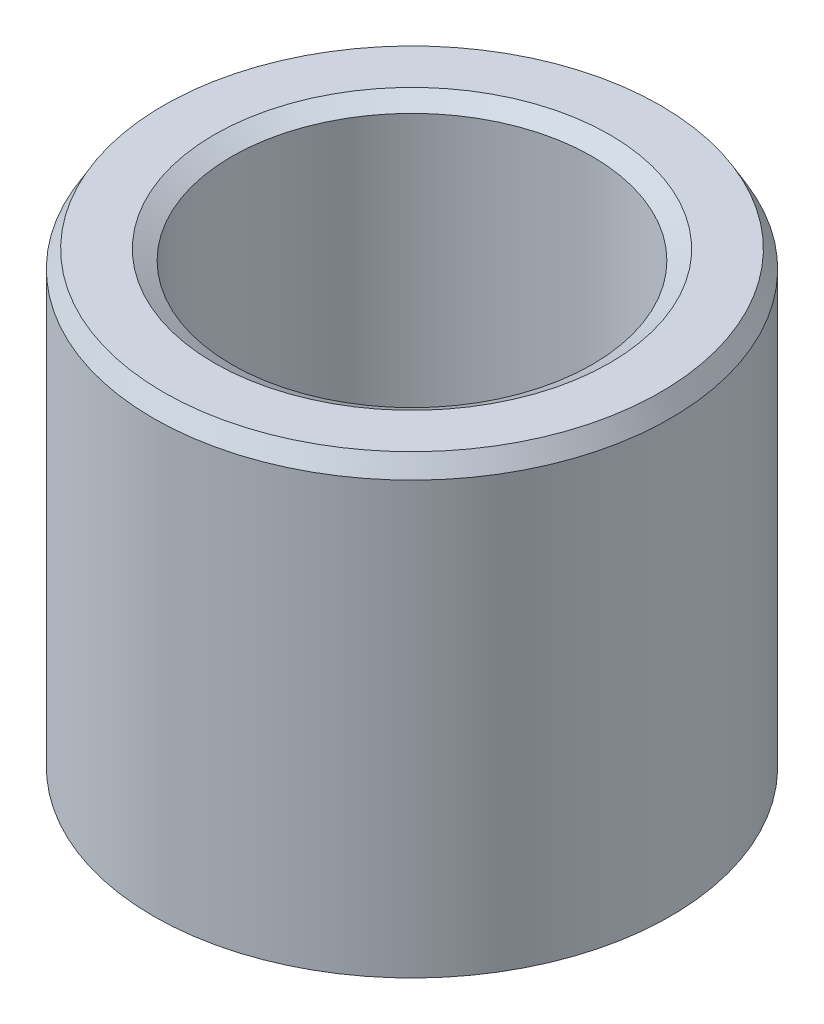
ISO-10303-21;
HEADER;
FILE_DESCRIPTION(('STEP AP214'),'2;1');
FILE_NAME('part.step','',(''),(''),'','','');
FILE_SCHEMA(('AUTOMOTIVE_DESIGN { 1 0 10303 214 1 1 1 1 }'));
ENDSEC;
DATA;
#1=APPLICATION_CONTEXT('core data for automotive mechanical design processes');
#2=APPLICATION_PROTOCOL_DEFINITION('international standard','automotive_design',2000,#1);
#3=PRODUCT_CONTEXT('',#1,'mechanical');
#4=PRODUCT('Part','Part','',(#3));
#5=PRODUCT_RELATED_PRODUCT_CATEGORY('part','',(#4));
#6=PRODUCT_DEFINITION_FORMATION('','',#4);
#7=PRODUCT_DEFINITION_CONTEXT('part definition',#1,'design');
#8=PRODUCT_DEFINITION('design','',#6,#7);
#9=PRODUCT_DEFINITION_SHAPE('','',#8);
#10=(LENGTH_UNIT() NAMED_UNIT(*) SI_UNIT(.MILLI.,.METRE.));
#11=(NAMED_UNIT(*) PLANE_ANGLE_UNIT() SI_UNIT($,.RADIAN.));
#12=(NAMED_UNIT(*) SI_UNIT($,.STERADIAN.) SOLID_ANGLE_UNIT());
#13=UNCERTAINTY_MEASURE_WITH_UNIT(LENGTH_MEASURE(1.E-05),#10,'distance_accuracy_value','');
#14=(GEOMETRIC_REPRESENTATION_CONTEXT(3) GLOBAL_UNCERTAINTY_ASSIGNED_CONTEXT((#13)) GLOBAL_UNIT_ASSIGNED_CONTEXT((#10,
#11,#12)) REPRESENTATION_CONTEXT('',''));
#15=CARTESIAN_POINT('',(0.,0.,0.));
#16=DIRECTION('',(0.,0.,1.));
#17=DIRECTION('',(1.,0.,0.));
#18=AXIS2_PLACEMENT_3D('',#15,#16,#17);
#19=CARTESIAN_POINT('',(0.,75.4030984293834,0.));
#20=DIRECTION('',(0.,-1.,0.));
#21=DIRECTION('',(0.,0.,-1.));
#22=AXIS2_PLACEMENT_3D('',#19,#20,#21);
#23=CYLINDRICAL_SURFACE('',#22,42.5);
#24=CARTESIAN_POINT('',(0.,1.66126296134479,0.));
#25=DIRECTION('',(0.,1.,0.));
#26=DIRECTION('',(0.,0.,1.));
#27=AXIS2_PLACEMENT_3D('',#24,#25,#26);
#28=CIRCLE('',#27,42.5);
#29=CARTESIAN_POINT('',(0.,1.66126296134478,-42.5));
#30=VERTEX_POINT('',#29);
#31=EDGE_CURVE('E10',#30,#30,#28,.T.);
#32=CARTESIAN_POINT('',(0.,72.5257065756022,0.));
#33=DIRECTION('',(0.,1.,0.));
#34=DIRECTION('',(0.,0.,1.));
#35=AXIS2_PLACEMENT_3D('',#32,#33,#34);
#36=CIRCLE('',#35,42.5);
#37=CARTESIAN_POINT('',(0.,72.5257065756022,-42.5));
#38=VERTEX_POINT('',#37);
#39=EDGE_CURVE('E50',#38,#38,#36,.F.);
#40=CARTESIAN_POINT('',(0.,1.66126296134478,-42.5));
#41=CARTESIAN_POINT('',(0.,2.3994342489933,-42.5));
#42=CARTESIAN_POINT('',(0.,3.13760553664181,-42.5));
#43=CARTESIAN_POINT('',(0.,4.61394811193884,-42.5));
#44=CARTESIAN_POINT('',(0.,5.35211939958735,-42.5));
#45=CARTESIAN_POINT('',(0.,6.82846197488438,-42.5));
#46=CARTESIAN_POINT('',(0.,7.5666332625329,-42.5));
#47=CARTESIAN_POINT('',(0.,9.04297583782992,-42.5));
#48=CARTESIAN_POINT('',(0.,9.78114712547844,-42.5));
#49=CARTESIAN_POINT('',(0.,11.2574897007755,-42.5));
#50=CARTESIAN_POINT('',(0.,11.995660988424,-42.5));
#51=CARTESIAN_POINT('',(0.,13.472003563721,-42.5));
#52=CARTESIAN_POINT('',(0.,14.2101748513695,-42.5));
#53=CARTESIAN_POINT('',(0.,15.6865174266666,-42.5));
#54=CARTESIAN_POINT('',(0.,16.4246887143151,-42.5));
#55=CARTESIAN_POINT('',(0.,17.9010312896121,-42.5));
#56=CARTESIAN_POINT('',(0.,18.6392025772606,-42.5));
#57=CARTESIAN_POINT('',(0.,20.1155451525576,-42.5));
#58=CARTESIAN_POINT('',(0.,20.8537164402062,-42.5));
#59=CARTESIAN_POINT('',(0.,22.3300590155032,-42.5));
#60=CARTESIAN_POINT('',(0.,23.0682303031517,-42.5));
#61=CARTESIAN_POINT('',(0.,24.5445728784487,-42.5));
#62=CARTESIAN_POINT('',(0.,25.2827441660972,-42.5));
#63=CARTESIAN_POINT('',(0.,26.7590867413943,-42.5));
#64=CARTESIAN_POINT('',(0.,27.4972580290428,-42.5));
#65=CARTESIAN_POINT('',(0.,28.9736006043398,-42.5));
#66=CARTESIAN_POINT('',(0.,29.7117718919883,-42.5));
#67=CARTESIAN_POINT('',(0.,31.1881144672854,-42.5));
#68=CARTESIAN_POINT('',(0.,31.9262857549339,-42.5));
#69=CARTESIAN_POINT('',(0.,33.4026283302309,-42.5));
#70=CARTESIAN_POINT('',(0.,34.1407996178794,-42.5));
#71=CARTESIAN_POINT('',(0.,35.6171421931764,-42.5));
#72=CARTESIAN_POINT('',(0.,36.355313480825,-42.5));
#73=CARTESIAN_POINT('',(0.,37.831656056122,-42.5));
#74=CARTESIAN_POINT('',(0.,38.5698273437705,-42.5));
#75=CARTESIAN_POINT('',(0.,40.0461699190675,-42.5));
#76=CARTESIAN_POINT('',(0.,40.7843412067161,-42.5));
#77=CARTESIAN_POINT('',(0.,42.2606837820131,-42.5));
#78=CARTESIAN_POINT('',(0.,42.9988550696616,-42.5));
#79=CARTESIAN_POINT('',(0.,44.4751976449586,-42.5));
#80=CARTESIAN_POINT('',(0.,45.2133689326071,-42.5));
#81=CARTESIAN_POINT('',(0.,46.6897115079042,-42.5));
#82=CARTESIAN_POINT('',(0.,47.4278827955527,-42.5));
#83=CARTESIAN_POINT('',(0.,48.9042253708497,-42.5));
#84=CARTESIAN_POINT('',(0.,49.6423966584982,-42.5));
#85=CARTESIAN_POINT('',(0.,51.1187392337953,-42.5));
#86=CARTESIAN_POINT('',(0.,51.8569105214438,-42.5));
#87=CARTESIAN_POINT('',(0.,53.3332530967408,-42.5));
#88=CARTESIAN_POINT('',(0.,54.0714243843893,-42.5));
#89=CARTESIAN_POINT('',(0.,55.5477669596863,-42.5));
#90=CARTESIAN_POINT('',(0.,56.2859382473349,-42.5));
#91=CARTESIAN_POINT('',(0.,57.7622808226319,-42.5));
#92=CARTESIAN_POINT('',(0.,58.5004521102804,-42.5));
#93=CARTESIAN_POINT('',(0.,59.9767946855774,-42.5));
#94=CARTESIAN_POINT('',(0.,60.7149659732259,-42.5));
#95=CARTESIAN_POINT('',(0.,62.191308548523,-42.5));
#96=CARTESIAN_POINT('',(0.,62.9294798361715,-42.5));
#97=CARTESIAN_POINT('',(0.,64.4058224114685,-42.5));
#98=CARTESIAN_POINT('',(0.,65.143993699117,-42.5));
#99=CARTESIAN_POINT('',(0.,66.6203362744141,-42.5));
#100=CARTESIAN_POINT('',(0.,67.3585075620626,-42.5));
#101=CARTESIAN_POINT('',(0.,68.8348501373596,-42.5));
#102=CARTESIAN_POINT('',(0.,69.5730214250081,-42.5));
#103=CARTESIAN_POINT('',(0.,71.0493640003051,-42.5));
#104=CARTESIAN_POINT('',(0.,71.7875352879537,-42.5));
#105=CARTESIAN_POINT('',(0.,72.5257065756022,-42.5));
#106=B_SPLINE_CURVE_WITH_KNOTS('',3,(#40,#41,#42,#43,#44,#45,#46,#47,#48,#49,#50,#51,#52,#53,
#54,#55,#56,#57,#58,#59,#60,#61,#62,#63,#64,#65,#66,#67,#68,#69,#70,#71,#72,#73,#74,#75,#76,#77,
#78,#79,#80,#81,#82,#83,#84,#85,#86,#87,#88,#89,#90,#91,#92,#93,#94,#95,#96,#97,#98,#99,#100,
#101,#102,#103,#104,#105),.UNSPECIFIED.,.F.,.F.,(4,2,2,2,2,2,2,2,2,2,2,2,2,2,2,2,2,2,2,2,2,2,2,
2,2,2,2,2,2,2,2,2,4),(0.,2.21451386294555,4.42902772589109,6.64354158883664,8.85805545178217,
11.0725693147277,13.2870831776733,15.5015970406188,17.7161109035643,19.9306247665099,
22.1451386294554,24.359652492401,26.5741663553465,28.7886802182921,31.0031940812376,
33.2177079441832,35.4322218071287,37.6467356700742,39.8612495330198,42.0757633959653,
44.2902772589109,46.5047911218564,48.719304984802,50.9338188477475,53.1483327106931,
55.3628465736386,57.5773604365841,59.7918742995297,62.0063881624752,64.2209020254208,
66.4354158883663,68.6499297513119,70.8644436142574),.UNSPECIFIED.);
#107=EDGE_CURVE('BSEAM39',#30,#38,#106,.T.);
#108=ORIENTED_EDGE('',*,*,#31,.T.);
#109=ORIENTED_EDGE('',*,*,#39,.T.);
#110=ORIENTED_EDGE('',*,*,#107,.T.);
#111=ORIENTED_EDGE('',*,*,#107,.F.);
#112=EDGE_LOOP('',(#108,#110,#109,#111));
#113=FACE_BOUND('',#112,.T.);
#114=ADVANCED_FACE('F39',(#113),#23,.T.);
#115=CARTESIAN_POINT('',(0.,75.4030984293834,0.));
#116=DIRECTION('',(0.,1.,0.));
#117=DIRECTION('',(0.,0.,1.));
#118=AXIS2_PLACEMENT_3D('',#115,#116,#117);
#119=PLANE('',#118);
#120=CARTESIAN_POINT('',(0.,75.4030984293834,0.));
#121=DIRECTION('',(0.,1.,0.));
#122=DIRECTION('',(0.,0.,1.));
#123=AXIS2_PLACEMENT_3D('',#120,#121,#122);
#124=CIRCLE('',#123,32.5040358014817);
#125=CARTESIAN_POINT('',(0.,75.4030984293834,32.5040358014817));
#126=VERTEX_POINT('',#125);
#127=EDGE_CURVE('E58',#126,#126,#124,.F.);
#128=ORIENTED_EDGE('',*,*,#127,.T.);
#129=EDGE_LOOP('',(#128));
#130=FACE_BOUND('',#129,.T.);
#131=CARTESIAN_POINT('',(0.,75.4030984293834,0.));
#132=DIRECTION('',(0.,1.,0.));
#133=DIRECTION('',(0.,0.,1.));
#134=AXIS2_PLACEMENT_3D('',#131,#132,#133);
#135=CIRCLE('',#134,40.8387370386554);
#136=CARTESIAN_POINT('',(0.,75.4030984293834,40.8387370386554));
#137=VERTEX_POINT('',#136);
#138=EDGE_CURVE('E61',#137,#137,#135,.T.);
#139=ORIENTED_EDGE('',*,*,#138,.T.);
#140=EDGE_LOOP('',(#139));
#141=FACE_BOUND('',#140,.T.);
#142=ADVANCED_FACE('F88',(#130,#141),#119,.T.);
#143=CARTESIAN_POINT('',(0.,0.,0.));
#144=DIRECTION('',(0.,1.,0.));
#145=DIRECTION('',(0.,0.,1.));
#146=AXIS2_PLACEMENT_3D('',#143,#144,#145);
#147=PLANE('',#146);
#148=CARTESIAN_POINT('',(0.,0.,0.));
#149=DIRECTION('',(0.,1.,0.));
#150=DIRECTION('',(0.,0.,1.));
#151=AXIS2_PLACEMENT_3D('',#148,#149,#150);
#152=CIRCLE('',#151,31.287906909045);
#153=CARTESIAN_POINT('',(0.,0.,-31.287906909045));
#154=VERTEX_POINT('',#153);
#155=EDGE_CURVE('E51',#154,#154,#152,.T.);
#156=ORIENTED_EDGE('',*,*,#155,.T.);
#157=EDGE_LOOP('',(#156));
#158=FACE_BOUND('',#157,.T.);
#159=CARTESIAN_POINT('',(0.,0.,0.));
#160=DIRECTION('',(0.,1.,0.));
#161=DIRECTION('',(0.,0.,1.));
#162=AXIS2_PLACEMENT_3D('',#159,#160,#161);
#163=CIRCLE('',#162,39.6226081462185);
#164=CARTESIAN_POINT('',(0.,0.,39.6226081462185));
#165=VERTEX_POINT('',#164);
#166=EDGE_CURVE('E54',#165,#165,#163,.F.);
#167=ORIENTED_EDGE('',*,*,#166,.T.);
#168=EDGE_LOOP('',(#167));
#169=FACE_BOUND('',#168,.T.);
#170=ADVANCED_FACE('F83',(#158,#169),#147,.F.);
#171=CARTESIAN_POINT('',(0.,75.4030984293834,0.));
#172=DIRECTION('',(0.,-1.,0.));
#173=DIRECTION('',(0.,0.,-1.));
#174=AXIS2_PLACEMENT_3D('',#171,#172,#173);
#175=CYLINDRICAL_SURFACE('',#174,29.6266439477002);
#176=CARTESIAN_POINT('',(0.,73.7418354680387,0.));
#177=DIRECTION('',(0.,1.,0.));
#178=DIRECTION('',(0.,0.,1.));
#179=AXIS2_PLACEMENT_3D('',#176,#177,#178);
#180=CIRCLE('',#179,29.6266439477002);
#181=CARTESIAN_POINT('',(0.,73.7418354680387,-29.6266439477002));
#182=VERTEX_POINT('',#181);
#183=EDGE_CURVE('E67',#182,#182,#180,.T.);
#184=CARTESIAN_POINT('',(0.,2.87739185378143,0.));
#185=DIRECTION('',(0.,1.,0.));
#186=DIRECTION('',(0.,0.,1.));
#187=AXIS2_PLACEMENT_3D('',#184,#185,#186);
#188=CIRCLE('',#187,29.6266439477002);
#189=CARTESIAN_POINT('',(0.,2.87739185378141,-29.6266439477002));
#190=VERTEX_POINT('',#189);
#191=EDGE_CURVE('E69',#190,#190,#188,.F.);
#192=CARTESIAN_POINT('',(0.,73.7418354680387,-29.6266439477002));
#193=CARTESIAN_POINT('',(0.,73.0036641803902,-29.6266439477002));
#194=CARTESIAN_POINT('',(0.,72.2654928927416,-29.6266439477002));
#195=CARTESIAN_POINT('',(0.,70.7891503174446,-29.6266439477002));
#196=CARTESIAN_POINT('',(0.,70.0509790297961,-29.6266439477002));
#197=CARTESIAN_POINT('',(0.,68.5746364544991,-29.6266439477002));
#198=CARTESIAN_POINT('',(0.,67.8364651668506,-29.6266439477002));
#199=CARTESIAN_POINT('',(0.,66.3601225915535,-29.6266439477002));
#200=CARTESIAN_POINT('',(0.,65.621951303905,-29.6266439477002));
#201=CARTESIAN_POINT('',(0.,64.145608728608,-29.6266439477002));
#202=CARTESIAN_POINT('',(0.,63.4074374409595,-29.6266439477002));
#203=CARTESIAN_POINT('',(0.,61.9310948656625,-29.6266439477002));
#204=CARTESIAN_POINT('',(0.,61.192923578014,-29.6266439477002));
#205=CARTESIAN_POINT('',(0.,59.7165810027169,-29.6266439477002));
#206=CARTESIAN_POINT('',(0.,58.9784097150684,-29.6266439477002));
#207=CARTESIAN_POINT('',(0.,57.5020671397714,-29.6266439477002));
#208=CARTESIAN_POINT('',(0.,56.7638958521229,-29.6266439477002));
#209=CARTESIAN_POINT('',(0.,55.2875532768258,-29.6266439477002));
#210=CARTESIAN_POINT('',(0.,54.5493819891773,-29.6266439477002));
#211=CARTESIAN_POINT('',(0.,53.0730394138803,-29.6266439477002));
#212=CARTESIAN_POINT('',(0.,52.3348681262318,-29.6266439477002));
#213=CARTESIAN_POINT('',(0.,50.8585255509348,-29.6266439477002));
#214=CARTESIAN_POINT('',(0.,50.1203542632863,-29.6266439477002));
#215=CARTESIAN_POINT('',(0.,48.6440116879892,-29.6266439477002));
#216=CARTESIAN_POINT('',(0.,47.9058404003407,-29.6266439477002));
#217=CARTESIAN_POINT('',(0.,46.4294978250437,-29.6266439477002));
#218=CARTESIAN_POINT('',(0.,45.6913265373952,-29.6266439477002));
#219=CARTESIAN_POINT('',(0.,44.2149839620982,-29.6266439477002));
#220=CARTESIAN_POINT('',(0.,43.4768126744496,-29.6266439477002));
#221=CARTESIAN_POINT('',(0.,42.0004700991526,-29.6266439477002));
#222=CARTESIAN_POINT('',(0.,41.2622988115041,-29.6266439477002));
#223=CARTESIAN_POINT('',(0.,39.7859562362071,-29.6266439477002));
#224=CARTESIAN_POINT('',(0.,39.0477849485586,-29.6266439477002));
#225=CARTESIAN_POINT('',(0.,37.5714423732615,-29.6266439477002));
#226=CARTESIAN_POINT('',(0.,36.833271085613,-29.6266439477002));
#227=CARTESIAN_POINT('',(0.,35.356928510316,-29.6266439477002));
#228=CARTESIAN_POINT('',(0.,34.6187572226675,-29.6266439477002));
#229=CARTESIAN_POINT('',(0.,33.1424146473705,-29.6266439477002));
#230=CARTESIAN_POINT('',(0.,32.4042433597219,-29.6266439477002));
#231=CARTESIAN_POINT('',(0.,30.9279007844249,-29.6266439477002));
#232=CARTESIAN_POINT('',(0.,30.1897294967764,-29.6266439477002));
#233=CARTESIAN_POINT('',(0.,28.7133869214794,-29.6266439477002));
#234=CARTESIAN_POINT('',(0.,27.9752156338309,-29.6266439477002));
#235=CARTESIAN_POINT('',(0.,26.4988730585338,-29.6266439477002));
#236=CARTESIAN_POINT('',(0.,25.7607017708853,-29.6266439477002));
#237=CARTESIAN_POINT('',(0.,24.2843591955883,-29.6266439477002));
#238=CARTESIAN_POINT('',(0.,23.5461879079398,-29.6266439477002));
#239=CARTESIAN_POINT('',(0.,22.0698453326427,-29.6266439477002));
#240=CARTESIAN_POINT('',(0.,21.3316740449942,-29.6266439477002));
#241=CARTESIAN_POINT('',(0.,19.8553314696972,-29.6266439477002));
#242=CARTESIAN_POINT('',(0.,19.1171601820487,-29.6266439477002));
#243=CARTESIAN_POINT('',(0.,17.6408176067517,-29.6266439477002));
#244=CARTESIAN_POINT('',(0.,16.9026463191032,-29.6266439477002));
#245=CARTESIAN_POINT('',(0.,15.4263037438061,-29.6266439477002));
#246=CARTESIAN_POINT('',(0.,14.6881324561576,-29.6266439477002));
#247=CARTESIAN_POINT('',(0.,13.2117898808606,-29.6266439477002));
#248=CARTESIAN_POINT('',(0.,12.4736185932121,-29.6266439477002));
#249=CARTESIAN_POINT('',(0.,10.9972760179151,-29.6266439477002));
#250=CARTESIAN_POINT('',(0.,10.2591047302665,-29.6266439477002));
#251=CARTESIAN_POINT('',(0.,8.78276215496952,-29.6266439477002));
#252=CARTESIAN_POINT('',(0.,8.044590867321,-29.6266439477002));
#253=CARTESIAN_POINT('',(0.,6.56824829202397,-29.6266439477002));
#254=CARTESIAN_POINT('',(0.,5.83007700437545,-29.6266439477002));
#255=CARTESIAN_POINT('',(0.,4.35373442907843,-29.6266439477002));
#256=CARTESIAN_POINT('',(0.,3.61556314142992,-29.6266439477002));
#257=CARTESIAN_POINT('',(0.,2.87739185378141,-29.6266439477002));
#258=B_SPLINE_CURVE_WITH_KNOTS('',3,(#192,#193,#194,#195,#196,#197,#198,#199,#200,#201,#202,
#203,#204,#205,#206,#207,#208,#209,#210,#211,#212,#213,#214,#215,#216,#217,#218,#219,#220,#221,
#222,#223,#224,#225,#226,#227,#228,#229,#230,#231,#232,#233,#234,#235,#236,#237,#238,#239,#240,
#241,#242,#243,#244,#245,#246,#247,#248,#249,#250,#251,#252,#253,#254,#255,#256,#257),
.UNSPECIFIED.,.F.,.F.,(4,2,2,2,2,2,2,2,2,2,2,2,2,2,2,2,2,2,2,2,2,2,2,2,2,2,2,2,2,2,2,2,4),(0.,
2.21451386294555,4.42902772589109,6.64354158883662,8.85805545178217,11.0725693147277,
13.2870831776732,15.5015970406188,17.7161109035643,19.9306247665099,22.1451386294554,
24.3596524924009,26.5741663553465,28.788680218292,31.0031940812376,33.2177079441831,
35.4322218071286,37.6467356700742,39.8612495330197,42.0757633959653,44.2902772589108,
46.5047911218563,48.7193049848019,50.9338188477474,53.148332710693,55.3628465736385,
57.577360436584,59.7918742995296,62.0063881624751,64.2209020254206,66.4354158883662,
68.6499297513117,70.8644436142573),.UNSPECIFIED.);
#259=EDGE_CURVE('BSEAM71',#182,#190,#258,.T.);
#260=ORIENTED_EDGE('',*,*,#183,.T.);
#261=ORIENTED_EDGE('',*,*,#191,.T.);
#262=ORIENTED_EDGE('',*,*,#259,.T.);
#263=ORIENTED_EDGE('',*,*,#259,.F.);
#264=EDGE_LOOP('',(#260,#262,#261,#263));
#265=FACE_BOUND('',#264,.T.);
#266=ADVANCED_FACE('F71',(#265),#175,.F.);
#267=CARTESIAN_POINT('',(0.,73.7418354680387,0.));
#268=DIRECTION('',(0.,1.,0.));
#269=DIRECTION('',(0.,0.,1.));
#270=AXIS2_PLACEMENT_3D('',#267,#268,#269);
#271=CONICAL_SURFACE('',#270,29.6266439477002,1.0471975511966);
#272=ORIENTED_EDGE('',*,*,#127,.F.);
#273=EDGE_LOOP('',(#272));
#274=FACE_BOUND('',#273,.T.);
#275=ORIENTED_EDGE('',*,*,#183,.F.);
#276=EDGE_LOOP('',(#275));
#277=FACE_BOUND('',#276,.T.);
#278=ADVANCED_FACE('F77',(#274,#277),#271,.F.);
#279=CARTESIAN_POINT('',(0.,0.,0.));
#280=DIRECTION('',(0.,-1.,0.));
#281=DIRECTION('',(0.,0.,-1.));
#282=AXIS2_PLACEMENT_3D('',#279,#280,#281);
#283=CONICAL_SURFACE('',#282,31.287906909045,0.523598775598296);
#284=CARTESIAN_POINT('',(0.,2.87739185378143,-29.6266439477002));
#285=CARTESIAN_POINT('',(0.,2.8474190219712,-29.6439487702142));
#286=CARTESIAN_POINT('',(0.,2.81744619016098,-29.6612535927283));
#287=CARTESIAN_POINT('',(0.,2.75750052654053,-29.6958632377563));
#288=CARTESIAN_POINT('',(0.,2.72752769473031,-29.7131680602703));
#289=CARTESIAN_POINT('',(0.,2.66758203110986,-29.7477777052983));
#290=CARTESIAN_POINT('',(0.,2.63760919929964,-29.7650825278123));
#291=CARTESIAN_POINT('',(0.,2.5776635356792,-29.7996921728403));
#292=CARTESIAN_POINT('',(0.,2.54769070386897,-29.8169969953543));
#293=CARTESIAN_POINT('',(0.,2.48774504024853,-29.8516066403823));
#294=CARTESIAN_POINT('',(0.,2.4577722084383,-29.8689114628963));
#295=CARTESIAN_POINT('',(0.,2.39782654481786,-29.9035211079244));
#296=CARTESIAN_POINT('',(0.,2.36785371300763,-29.9208259304384));
#297=CARTESIAN_POINT('',(0.,2.30790804938719,-29.9554355754664));
#298=CARTESIAN_POINT('',(0.,2.27793521757696,-29.9727403979804));
#299=CARTESIAN_POINT('',(0.,2.21798955395652,-30.0073500430084));
#300=CARTESIAN_POINT('',(0.,2.18801672214629,-30.0246548655224));
#301=CARTESIAN_POINT('',(0.,2.12807105852585,-30.0592645105504));
#302=CARTESIAN_POINT('',(0.,2.09809822671562,-30.0765693330644));
#303=CARTESIAN_POINT('',(0.,2.03815256309518,-30.1111789780925));
#304=CARTESIAN_POINT('',(0.,2.00817973128495,-30.1284838006065));
#305=CARTESIAN_POINT('',(0.,1.94823406766451,-30.1630934456345));
#306=CARTESIAN_POINT('',(0.,1.91826123585428,-30.1803982681485));
#307=CARTESIAN_POINT('',(0.,1.85831557223384,-30.2150079131765));
#308=CARTESIAN_POINT('',(0.,1.82834274042361,-30.2323127356905));
#309=CARTESIAN_POINT('',(0.,1.76839707680317,-30.2669223807185));
#310=CARTESIAN_POINT('',(0.,1.73842424499295,-30.2842272032325));
#311=CARTESIAN_POINT('',(0.,1.6784785813725,-30.3188368482605));
#312=CARTESIAN_POINT('',(0.,1.64850574956228,-30.3361416707746));
#313=CARTESIAN_POINT('',(0.,1.58856008594183,-30.3707513158026));
#314=CARTESIAN_POINT('',(0.,1.55858725413161,-30.3880561383166));
#315=CARTESIAN_POINT('',(0.,1.49864159051116,-30.4226657833446));
#316=CARTESIAN_POINT('',(0.,1.46866875870094,-30.4399706058586));
#317=CARTESIAN_POINT('',(0.,1.40872309508049,-30.4745802508866));
#318=CARTESIAN_POINT('',(0.,1.37875026327027,-30.4918850734006));
#319=CARTESIAN_POINT('',(0.,1.31880459964982,-30.5264947184286));
#320=CARTESIAN_POINT('',(0.,1.2888317678396,-30.5437995409426));
#321=CARTESIAN_POINT('',(0.,1.22888610421915,-30.5784091859707));
#322=CARTESIAN_POINT('',(0.,1.19891327240893,-30.5957140084847));
#323=CARTESIAN_POINT('',(0.,1.13896760878848,-30.6303236535127));
#324=CARTESIAN_POINT('',(0.,1.10899477697826,-30.6476284760267));
#325=CARTESIAN_POINT('',(0.,1.04904911335781,-30.6822381210547));
#326=CARTESIAN_POINT('',(0.,1.01907628154759,-30.6995429435687));
#327=CARTESIAN_POINT('',(0.,0.959130617927142,-30.7341525885967));
#328=CARTESIAN_POINT('',(0.,0.929157786116919,-30.7514574111107));
#329=CARTESIAN_POINT('',(0.,0.869212122496473,-30.7860670561387));
#330=CARTESIAN_POINT('',(0.,0.83923929068625,-30.8033718786528));
#331=CARTESIAN_POINT('',(0.,0.779293627065803,-30.8379815236808));
#332=CARTESIAN_POINT('',(0.,0.74932079525558,-30.8552863461948));
#333=CARTESIAN_POINT('',(0.,0.689375131635133,-30.8898959912228));
#334=CARTESIAN_POINT('',(0.,0.65940229982491,-30.9072008137368));
#335=CARTESIAN_POINT('',(0.,0.599456636204464,-30.9418104587648));
#336=CARTESIAN_POINT('',(0.,0.569483804394241,-30.9591152812788));
#337=CARTESIAN_POINT('',(0.,0.509538140773795,-30.9937249263068));
#338=CARTESIAN_POINT('',(0.,0.479565308963571,-31.0110297488208));
#339=CARTESIAN_POINT('',(0.,0.419619645343125,-31.0456393938489));
#340=CARTESIAN_POINT('',(0.,0.389646813532902,-31.0629442163629));
#341=CARTESIAN_POINT('',(0.,0.329701149912455,-31.0975538613909));
#342=CARTESIAN_POINT('',(0.,0.299728318102232,-31.1148586839049));
#343=CARTESIAN_POINT('',(0.,0.239782654481786,-31.1494683289329));
#344=CARTESIAN_POINT('',(0.,0.209809822671562,-31.1667731514469));
#345=CARTESIAN_POINT('',(0.,0.149864159051116,-31.2013827964749));
#346=CARTESIAN_POINT('',(0.,0.119891327240893,-31.2186876189889));
#347=CARTESIAN_POINT('',(0.,0.0599456636204464,-31.253297264017));
#348=CARTESIAN_POINT('',(0.,0.0299728318102232,-31.270602086531));
#349=CARTESIAN_POINT('',(0.,0.,-31.287906909045));
#350=B_SPLINE_CURVE_WITH_KNOTS('',3,(#284,#285,#286,#287,#288,#289,#290,#291,#292,#293,#294,
#295,#296,#297,#298,#299,#300,#301,#302,#303,#304,#305,#306,#307,#308,#309,#310,#311,#312,#313,
#314,#315,#316,#317,#318,#319,#320,#321,#322,#323,#324,#325,#326,#327,#328,#329,#330,#331,#332,
#333,#334,#335,#336,#337,#338,#339,#340,#341,#342,#343,#344,#345,#346,#347,#348,#349),
.UNSPECIFIED.,.F.,.F.,(4,2,2,2,2,2,2,2,2,2,2,2,2,2,2,2,2,2,2,2,2,2,2,2,2,2,2,2,2,2,2,2,4),(0.,
0.103828935084046,0.207657870168092,0.311486805252138,0.415315740336185,0.519144675420231,
0.622973610504277,0.726802545588323,0.830631480672369,0.934460415756415,1.03828935084046,
1.14211828592451,1.24594722100855,1.3497761560926,1.45360509117665,1.55743402626069,
1.66126296134474,1.76509189642879,1.86892083151283,1.97274976659688,2.07657870168092,
2.18040763676497,2.28423657184902,2.38806550693306,2.49189444201711,2.59572337710115,
2.6995523121852,2.80338124726925,2.90721018235329,3.01103911743734,3.11486805252139,
3.21869698760543,3.32252592268948),.UNSPECIFIED.);
#351=EDGE_CURVE('BSEAM73',#190,#154,#350,.T.);
#352=ORIENTED_EDGE('',*,*,#191,.F.);
#353=ORIENTED_EDGE('',*,*,#155,.F.);
#354=ORIENTED_EDGE('',*,*,#351,.T.);
#355=ORIENTED_EDGE('',*,*,#351,.F.);
#356=EDGE_LOOP('',(#352,#354,#353,#355));
#357=FACE_BOUND('',#356,.T.);
#358=ADVANCED_FACE('F73',(#357),#283,.F.);
#359=CARTESIAN_POINT('',(0.,1.66126296134479,0.));
#360=DIRECTION('',(0.,1.,0.));
#361=DIRECTION('',(0.,0.,1.));
#362=AXIS2_PLACEMENT_3D('',#359,#360,#361);
#363=CONICAL_SURFACE('',#362,42.5,1.0471975511966);
#364=ORIENTED_EDGE('',*,*,#166,.F.);
#365=EDGE_LOOP('',(#364));
#366=FACE_BOUND('',#365,.T.);
#367=ORIENTED_EDGE('',*,*,#31,.F.);
#368=EDGE_LOOP('',(#367));
#369=FACE_BOUND('',#368,.T.);
#370=ADVANCED_FACE('F76',(#366,#369),#363,.T.);
#371=CARTESIAN_POINT('',(0.,75.4030984293834,0.));
#372=DIRECTION('',(0.,-1.,0.));
#373=DIRECTION('',(0.,0.,-1.));
#374=AXIS2_PLACEMENT_3D('',#371,#372,#373);
#375=CONICAL_SURFACE('',#374,40.8387370386554,0.52359877559829);
#376=ORIENTED_EDGE('',*,*,#39,.F.);
#377=EDGE_LOOP('',(#376));
#378=FACE_BOUND('',#377,.T.);
#379=ORIENTED_EDGE('',*,*,#138,.F.);
#380=EDGE_LOOP('',(#379));
#381=FACE_BOUND('',#380,.T.);
#382=ADVANCED_FACE('F45',(#378,#381),#375,.T.);
#383=CLOSED_SHELL('',(#114,#142,#170,#266,#278,#358,#370,#382));
#384=MANIFOLD_SOLID_BREP('B2',#383);
#385=ADVANCED_BREP_SHAPE_REPRESENTATION('',(#18,#384),#14);
#386=SHAPE_DEFINITION_REPRESENTATION(#9,#385);
ENDSEC;
END-ISO-10303-21;
